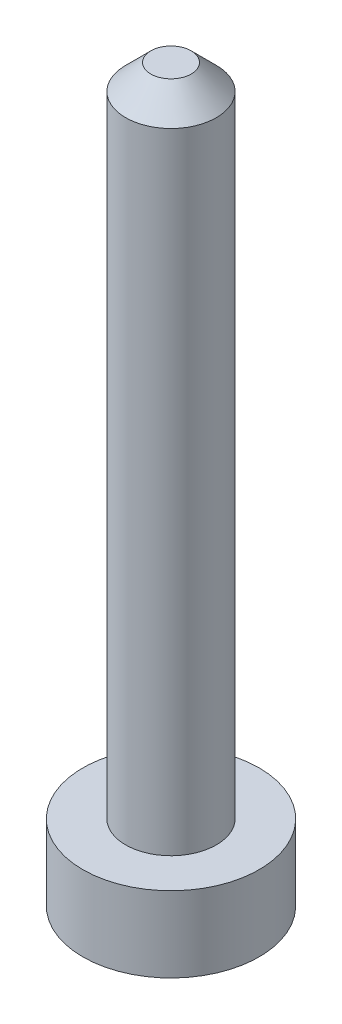
ISO-10303-21;
HEADER;
FILE_DESCRIPTION(('STEP AP214'),'2;1');
FILE_NAME('part.step','',(''),(''),'','','');
FILE_SCHEMA(('AUTOMOTIVE_DESIGN { 1 0 10303 214 1 1 1 1 }'));
ENDSEC;
DATA;
#1=APPLICATION_CONTEXT('core data for automotive mechanical design processes');
#2=APPLICATION_PROTOCOL_DEFINITION('international standard','automotive_design',2000,#1);
#3=PRODUCT_CONTEXT('',#1,'mechanical');
#4=PRODUCT('Part','Part','',(#3));
#5=PRODUCT_RELATED_PRODUCT_CATEGORY('part','',(#4));
#6=PRODUCT_DEFINITION_FORMATION('','',#4);
#7=PRODUCT_DEFINITION_CONTEXT('part definition',#1,'design');
#8=PRODUCT_DEFINITION('design','',#6,#7);
#9=PRODUCT_DEFINITION_SHAPE('','',#8);
#10=(LENGTH_UNIT() NAMED_UNIT(*) SI_UNIT(.MILLI.,.METRE.));
#11=(NAMED_UNIT(*) PLANE_ANGLE_UNIT() SI_UNIT($,.RADIAN.));
#12=(NAMED_UNIT(*) SI_UNIT($,.STERADIAN.) SOLID_ANGLE_UNIT());
#13=UNCERTAINTY_MEASURE_WITH_UNIT(LENGTH_MEASURE(1.E-05),#10,'distance_accuracy_value','');
#14=(GEOMETRIC_REPRESENTATION_CONTEXT(3) GLOBAL_UNCERTAINTY_ASSIGNED_CONTEXT((#13)) GLOBAL_UNIT_ASSIGNED_CONTEXT((#10,
#11,#12)) REPRESENTATION_CONTEXT('',''));
#15=CARTESIAN_POINT('',(0.,0.,0.));
#16=DIRECTION('',(0.,0.,1.));
#17=DIRECTION('',(1.,0.,0.));
#18=AXIS2_PLACEMENT_3D('',#15,#16,#17);
#19=CARTESIAN_POINT('',(0.,-3.,0.));
#20=DIRECTION('',(0.,1.,0.));
#21=DIRECTION('',(0.,0.,1.));
#22=AXIS2_PLACEMENT_3D('',#19,#20,#21);
#23=CYLINDRICAL_SURFACE('',#22,3.5);
#24=CARTESIAN_POINT('',(0.,-3.,0.));
#25=DIRECTION('',(0.,1.,0.));
#26=DIRECTION('',(0.,0.,1.));
#27=AXIS2_PLACEMENT_3D('',#24,#25,#26);
#28=CIRCLE('',#27,3.5);
#29=CARTESIAN_POINT('',(0.,-3.,3.5));
#30=VERTEX_POINT('',#29);
#31=EDGE_CURVE('E46',#30,#30,#28,.T.);
#32=ORIENTED_EDGE('',*,*,#31,.T.);
#33=EDGE_LOOP('',(#32));
#34=FACE_BOUND('',#33,.T.);
#35=CARTESIAN_POINT('',(0.,0.,0.));
#36=DIRECTION('',(0.,1.,0.));
#37=DIRECTION('',(0.,0.,1.));
#38=AXIS2_PLACEMENT_3D('',#35,#36,#37);
#39=CIRCLE('',#38,3.5);
#40=CARTESIAN_POINT('',(0.,0.,3.5));
#41=VERTEX_POINT('',#40);
#42=EDGE_CURVE('E50',#41,#41,#39,.T.);
#43=ORIENTED_EDGE('',*,*,#42,.F.);
#44=EDGE_LOOP('',(#43));
#45=FACE_BOUND('',#44,.T.);
#46=ADVANCED_FACE('F35',(#34,#45),#23,.T.);
#47=CARTESIAN_POINT('',(0.,-3.,0.));
#48=DIRECTION('',(0.,1.,0.));
#49=DIRECTION('',(0.,0.,1.));
#50=AXIS2_PLACEMENT_3D('',#47,#48,#49);
#51=PLANE('',#50);
#52=ORIENTED_EDGE('',*,*,#31,.F.);
#53=EDGE_LOOP('',(#52));
#54=FACE_BOUND('',#53,.T.);
#55=ADVANCED_FACE('F64',(#54),#51,.F.);
#56=CARTESIAN_POINT('',(0.,0.,0.));
#57=DIRECTION('',(0.,1.,0.));
#58=DIRECTION('',(0.,0.,1.));
#59=AXIS2_PLACEMENT_3D('',#56,#57,#58);
#60=PLANE('',#59);
#61=CARTESIAN_POINT('',(0.,0.,0.));
#62=DIRECTION('',(0.,1.,0.));
#63=DIRECTION('',(0.,0.,1.));
#64=AXIS2_PLACEMENT_3D('',#61,#62,#63);
#65=CIRCLE('',#64,1.8);
#66=CARTESIAN_POINT('',(0.,0.,-1.8));
#67=VERTEX_POINT('',#66);
#68=EDGE_CURVE('E54',#67,#67,#65,.T.);
#69=ORIENTED_EDGE('',*,*,#68,.F.);
#70=EDGE_LOOP('',(#69));
#71=FACE_BOUND('',#70,.T.);
#72=ORIENTED_EDGE('',*,*,#42,.T.);
#73=EDGE_LOOP('',(#72));
#74=FACE_BOUND('',#73,.T.);
#75=ADVANCED_FACE('F61',(#71,#74),#60,.T.);
#76=CARTESIAN_POINT('',(0.,26.,0.));
#77=DIRECTION('',(0.,-1.,0.));
#78=DIRECTION('',(0.,0.,-1.));
#79=AXIS2_PLACEMENT_3D('',#76,#77,#78);
#80=CYLINDRICAL_SURFACE('',#79,1.8);
#81=CARTESIAN_POINT('',(0.,25.,0.));
#82=DIRECTION('',(0.,1.,0.));
#83=DIRECTION('',(0.,0.,1.));
#84=AXIS2_PLACEMENT_3D('',#81,#82,#83);
#85=CIRCLE('',#84,1.8);
#86=CARTESIAN_POINT('',(0.,25.,-1.8));
#87=VERTEX_POINT('',#86);
#88=EDGE_CURVE('E10',#87,#87,#85,.F.);
#89=CARTESIAN_POINT('',(0.,25.,-1.8));
#90=CARTESIAN_POINT('',(0.,24.7395833333333,-1.8));
#91=CARTESIAN_POINT('',(0.,24.4791666666667,-1.8));
#92=CARTESIAN_POINT('',(0.,23.9583333333333,-1.8));
#93=CARTESIAN_POINT('',(0.,23.6979166666667,-1.8));
#94=CARTESIAN_POINT('',(0.,23.1770833333333,-1.8));
#95=CARTESIAN_POINT('',(0.,22.9166666666667,-1.8));
#96=CARTESIAN_POINT('',(0.,22.3958333333333,-1.8));
#97=CARTESIAN_POINT('',(0.,22.1354166666667,-1.8));
#98=CARTESIAN_POINT('',(0.,21.6145833333333,-1.8));
#99=CARTESIAN_POINT('',(0.,21.3541666666667,-1.8));
#100=CARTESIAN_POINT('',(0.,20.8333333333333,-1.8));
#101=CARTESIAN_POINT('',(0.,20.5729166666667,-1.8));
#102=CARTESIAN_POINT('',(0.,20.0520833333333,-1.8));
#103=CARTESIAN_POINT('',(0.,19.7916666666667,-1.8));
#104=CARTESIAN_POINT('',(0.,19.2708333333333,-1.8));
#105=CARTESIAN_POINT('',(0.,19.0104166666667,-1.8));
#106=CARTESIAN_POINT('',(0.,18.4895833333333,-1.8));
#107=CARTESIAN_POINT('',(0.,18.2291666666667,-1.8));
#108=CARTESIAN_POINT('',(0.,17.7083333333333,-1.8));
#109=CARTESIAN_POINT('',(0.,17.4479166666667,-1.8));
#110=CARTESIAN_POINT('',(0.,16.9270833333333,-1.8));
#111=CARTESIAN_POINT('',(0.,16.6666666666667,-1.8));
#112=CARTESIAN_POINT('',(0.,16.1458333333333,-1.8));
#113=CARTESIAN_POINT('',(0.,15.8854166666667,-1.8));
#114=CARTESIAN_POINT('',(0.,15.3645833333333,-1.8));
#115=CARTESIAN_POINT('',(0.,15.1041666666667,-1.8));
#116=CARTESIAN_POINT('',(0.,14.5833333333333,-1.8));
#117=CARTESIAN_POINT('',(0.,14.3229166666667,-1.8));
#118=CARTESIAN_POINT('',(0.,13.8020833333333,-1.8));
#119=CARTESIAN_POINT('',(0.,13.5416666666667,-1.8));
#120=CARTESIAN_POINT('',(0.,13.0208333333333,-1.8));
#121=CARTESIAN_POINT('',(0.,12.7604166666667,-1.8));
#122=CARTESIAN_POINT('',(0.,12.2395833333333,-1.8));
#123=CARTESIAN_POINT('',(0.,11.9791666666667,-1.8));
#124=CARTESIAN_POINT('',(0.,11.4583333333333,-1.8));
#125=CARTESIAN_POINT('',(0.,11.1979166666667,-1.8));
#126=CARTESIAN_POINT('',(0.,10.6770833333333,-1.8));
#127=CARTESIAN_POINT('',(0.,10.4166666666667,-1.8));
#128=CARTESIAN_POINT('',(0.,9.89583333333334,-1.8));
#129=CARTESIAN_POINT('',(0.,9.63541666666667,-1.8));
#130=CARTESIAN_POINT('',(0.,9.11458333333334,-1.8));
#131=CARTESIAN_POINT('',(0.,8.85416666666667,-1.8));
#132=CARTESIAN_POINT('',(0.,8.33333333333334,-1.8));
#133=CARTESIAN_POINT('',(0.,8.07291666666667,-1.8));
#134=CARTESIAN_POINT('',(0.,7.55208333333334,-1.8));
#135=CARTESIAN_POINT('',(0.,7.29166666666667,-1.8));
#136=CARTESIAN_POINT('',(0.,6.77083333333334,-1.8));
#137=CARTESIAN_POINT('',(0.,6.51041666666667,-1.8));
#138=CARTESIAN_POINT('',(0.,5.98958333333334,-1.8));
#139=CARTESIAN_POINT('',(0.,5.72916666666667,-1.8));
#140=CARTESIAN_POINT('',(0.,5.20833333333334,-1.8));
#141=CARTESIAN_POINT('',(0.,4.94791666666667,-1.8));
#142=CARTESIAN_POINT('',(0.,4.42708333333334,-1.8));
#143=CARTESIAN_POINT('',(0.,4.16666666666667,-1.8));
#144=CARTESIAN_POINT('',(0.,3.64583333333334,-1.8));
#145=CARTESIAN_POINT('',(0.,3.38541666666667,-1.8));
#146=CARTESIAN_POINT('',(0.,2.86458333333334,-1.8));
#147=CARTESIAN_POINT('',(0.,2.60416666666667,-1.8));
#148=CARTESIAN_POINT('',(0.,2.08333333333334,-1.8));
#149=CARTESIAN_POINT('',(0.,1.82291666666667,-1.8));
#150=CARTESIAN_POINT('',(0.,1.30208333333333,-1.8));
#151=CARTESIAN_POINT('',(0.,1.04166666666667,-1.8));
#152=CARTESIAN_POINT('',(0.,0.520833333333334,-1.8));
#153=CARTESIAN_POINT('',(0.,0.260416666666667,-1.8));
#154=CARTESIAN_POINT('',(0.,0.,-1.8));
#155=B_SPLINE_CURVE_WITH_KNOTS('',3,(#89,#90,#91,#92,#93,#94,#95,#96,#97,#98,#99,#100,#101,#102,
#103,#104,#105,#106,#107,#108,#109,#110,#111,#112,#113,#114,#115,#116,#117,#118,#119,#120,#121,
#122,#123,#124,#125,#126,#127,#128,#129,#130,#131,#132,#133,#134,#135,#136,#137,#138,#139,#140,
#141,#142,#143,#144,#145,#146,#147,#148,#149,#150,#151,#152,#153,#154),.UNSPECIFIED.,.F.,.F.,(4,
2,2,2,2,2,2,2,2,2,2,2,2,2,2,2,2,2,2,2,2,2,2,2,2,2,2,2,2,2,2,2,4),(0.,0.781250000000001,1.5625,
2.34375,3.125,3.90625,4.6875,5.46875,6.25,7.03125,7.8125,8.59375,9.375,10.15625,10.9375,
11.71875,12.5,13.28125,14.0625,14.84375,15.625,16.40625,17.1875,17.96875,18.75,19.53125,20.3125,
21.09375,21.875,22.65625,23.4375,24.21875,25.),.UNSPECIFIED.);
#156=EDGE_CURVE('BSEAM59',#87,#67,#155,.T.);
#157=ORIENTED_EDGE('',*,*,#88,.T.);
#158=ORIENTED_EDGE('',*,*,#68,.T.);
#159=ORIENTED_EDGE('',*,*,#156,.T.);
#160=ORIENTED_EDGE('',*,*,#156,.F.);
#161=EDGE_LOOP('',(#157,#159,#158,#160));
#162=FACE_BOUND('',#161,.T.);
#163=ADVANCED_FACE('F59',(#162),#80,.T.);
#164=CARTESIAN_POINT('',(0.,26.,0.));
#165=DIRECTION('',(0.,1.,0.));
#166=DIRECTION('',(0.,0.,1.));
#167=AXIS2_PLACEMENT_3D('',#164,#165,#166);
#168=PLANE('',#167);
#169=CARTESIAN_POINT('',(0.,26.,0.));
#170=DIRECTION('',(0.,1.,0.));
#171=DIRECTION('',(0.,0.,1.));
#172=AXIS2_PLACEMENT_3D('',#169,#170,#171);
#173=CIRCLE('',#172,0.800000000000019);
#174=CARTESIAN_POINT('',(0.,26.,0.800000000000019));
#175=VERTEX_POINT('',#174);
#176=EDGE_CURVE('E42',#175,#175,#173,.T.);
#177=ORIENTED_EDGE('',*,*,#176,.T.);
#178=EDGE_LOOP('',(#177));
#179=FACE_BOUND('',#178,.T.);
#180=ADVANCED_FACE('F78',(#179),#168,.T.);
#181=CARTESIAN_POINT('',(0.,26.,0.));
#182=DIRECTION('',(0.,-1.,0.));
#183=DIRECTION('',(0.,0.,-1.));
#184=AXIS2_PLACEMENT_3D('',#181,#182,#183);
#185=CONICAL_SURFACE('',#184,0.800000000000019,0.785398163397447);
#186=ORIENTED_EDGE('',*,*,#88,.F.);
#187=EDGE_LOOP('',(#186));
#188=FACE_BOUND('',#187,.T.);
#189=ORIENTED_EDGE('',*,*,#176,.F.);
#190=EDGE_LOOP('',(#189));
#191=FACE_BOUND('',#190,.T.);
#192=ADVANCED_FACE('F37',(#188,#191),#185,.T.);
#193=CLOSED_SHELL('',(#46,#55,#75,#163,#180,#192));
#194=MANIFOLD_SOLID_BREP('B2',#193);
#195=ADVANCED_BREP_SHAPE_REPRESENTATION('',(#18,#194),#14);
#196=SHAPE_DEFINITION_REPRESENTATION(#9,#195);
ENDSEC;
END-ISO-10303-21;
